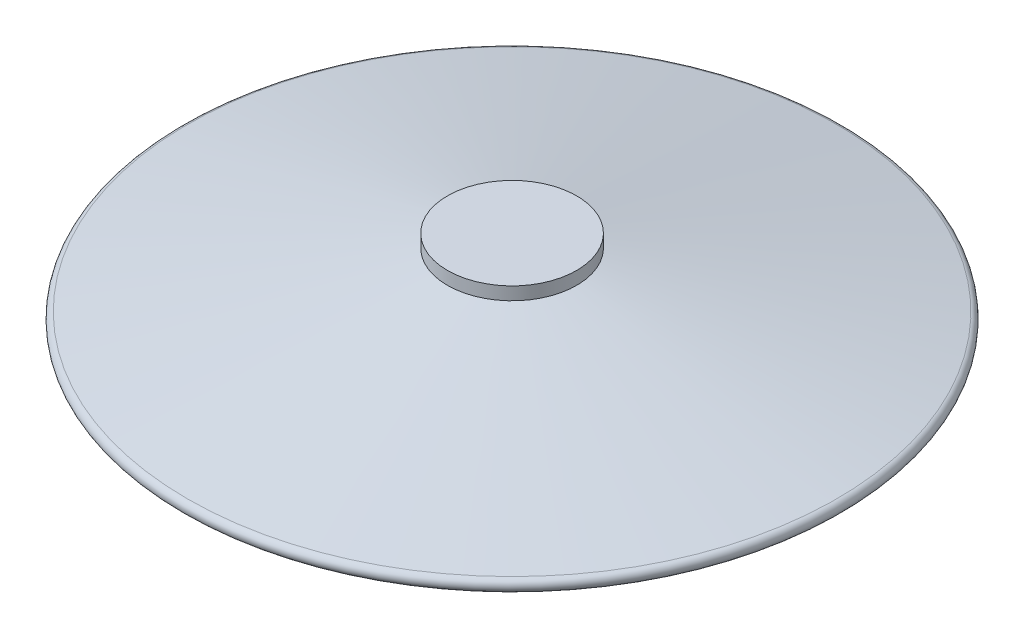
ISO-10303-21;
HEADER;
FILE_DESCRIPTION(('STEP AP214'),'2;1');
FILE_NAME('part.step','',(''),(''),'','','');
FILE_SCHEMA(('AUTOMOTIVE_DESIGN { 1 0 10303 214 1 1 1 1 }'));
ENDSEC;
DATA;
#1=APPLICATION_CONTEXT('core data for automotive mechanical design processes');
#2=APPLICATION_PROTOCOL_DEFINITION('international standard','automotive_design',2000,#1);
#3=PRODUCT_CONTEXT('',#1,'mechanical');
#4=PRODUCT('Part','Part','',(#3));
#5=PRODUCT_RELATED_PRODUCT_CATEGORY('part','',(#4));
#6=PRODUCT_DEFINITION_FORMATION('','',#4);
#7=PRODUCT_DEFINITION_CONTEXT('part definition',#1,'design');
#8=PRODUCT_DEFINITION('design','',#6,#7);
#9=PRODUCT_DEFINITION_SHAPE('','',#8);
#10=(LENGTH_UNIT() NAMED_UNIT(*) SI_UNIT(.MILLI.,.METRE.));
#11=(NAMED_UNIT(*) PLANE_ANGLE_UNIT() SI_UNIT($,.RADIAN.));
#12=(NAMED_UNIT(*) SI_UNIT($,.STERADIAN.) SOLID_ANGLE_UNIT());
#13=UNCERTAINTY_MEASURE_WITH_UNIT(LENGTH_MEASURE(1.E-05),#10,'distance_accuracy_value','');
#14=(GEOMETRIC_REPRESENTATION_CONTEXT(3) GLOBAL_UNCERTAINTY_ASSIGNED_CONTEXT((#13)) GLOBAL_UNIT_ASSIGNED_CONTEXT((#10,
#11,#12)) REPRESENTATION_CONTEXT('',''));
#15=CARTESIAN_POINT('',(0.,0.,0.));
#16=DIRECTION('',(0.,0.,1.));
#17=DIRECTION('',(1.,0.,0.));
#18=AXIS2_PLACEMENT_3D('',#15,#16,#17);
#19=CARTESIAN_POINT('',(0.,6.25,0.));
#20=DIRECTION('',(0.,1.,0.));
#21=DIRECTION('',(0.,0.,1.));
#22=AXIS2_PLACEMENT_3D('',#19,#20,#21);
#23=PLANE('',#22);
#24=CARTESIAN_POINT('',(0.,6.25,0.));
#25=DIRECTION('',(0.,1.,0.));
#26=DIRECTION('',(0.,0.,1.));
#27=AXIS2_PLACEMENT_3D('',#24,#25,#26);
#28=CIRCLE('',#27,5.);
#29=CARTESIAN_POINT('',(0.,6.25,5.));
#30=VERTEX_POINT('',#29);
#31=EDGE_CURVE('E10',#30,#30,#28,.T.);
#32=ORIENTED_EDGE('',*,*,#31,.T.);
#33=EDGE_LOOP('',(#32));
#34=FACE_BOUND('',#33,.T.);
#35=ADVANCED_FACE('F34',(#34),#23,.T.);
#36=CARTESIAN_POINT('',(0.,17.7201574060161,0.));
#37=DIRECTION('',(0.,1.,0.));
#38=DIRECTION('',(0.,0.,1.));
#39=AXIS2_PLACEMENT_3D('',#36,#37,#38);
#40=CYLINDRICAL_SURFACE('',#39,5.);
#41=CARTESIAN_POINT('',(0.,5.25,0.));
#42=DIRECTION('',(0.,1.,0.));
#43=DIRECTION('',(0.,0.,1.));
#44=AXIS2_PLACEMENT_3D('',#41,#42,#43);
#45=CIRCLE('',#44,5.);
#46=CARTESIAN_POINT('',(0.,5.25,5.));
#47=VERTEX_POINT('',#46);
#48=EDGE_CURVE('E40',#47,#47,#45,.T.);
#49=ORIENTED_EDGE('',*,*,#48,.T.);
#50=EDGE_LOOP('',(#49));
#51=FACE_BOUND('',#50,.T.);
#52=ORIENTED_EDGE('',*,*,#31,.F.);
#53=EDGE_LOOP('',(#52));
#54=FACE_BOUND('',#53,.T.);
#55=ADVANCED_FACE('F66',(#51,#54),#40,.T.);
#56=CARTESIAN_POINT('',(0.,5.25,0.));
#57=DIRECTION('',(0.,-1.,0.));
#58=DIRECTION('',(0.,0.,-1.));
#59=AXIS2_PLACEMENT_3D('',#56,#57,#58);
#60=CONICAL_SURFACE('',#59,5.,1.36194233895879);
#61=CARTESIAN_POINT('',(0.,0.989134585003687,0.));
#62=DIRECTION('',(0.,1.,0.));
#63=DIRECTION('',(0.,0.,1.));
#64=AXIS2_PLACEMENT_3D('',#61,#62,#63);
#65=CIRCLE('',#64,25.1036694639384);
#66=CARTESIAN_POINT('',(0.,0.989134585003687,25.1036694639384));
#67=VERTEX_POINT('',#66);
#68=EDGE_CURVE('E44',#67,#67,#65,.T.);
#69=ORIENTED_EDGE('',*,*,#68,.T.);
#70=EDGE_LOOP('',(#69));
#71=FACE_BOUND('',#70,.T.);
#72=ORIENTED_EDGE('',*,*,#48,.F.);
#73=EDGE_LOOP('',(#72));
#74=FACE_BOUND('',#73,.T.);
#75=ADVANCED_FACE('F63',(#71,#74),#60,.T.);
#76=CARTESIAN_POINT('',(0.,0.5,0.));
#77=DIRECTION('',(0.,1.,0.));
#78=DIRECTION('',(0.,0.,1.));
#79=AXIS2_PLACEMENT_3D('',#76,#77,#78);
#80=TOROIDAL_SURFACE('',#79,25.,0.5);
#81=CARTESIAN_POINT('',(0.,0.,0.));
#82=DIRECTION('',(0.,1.,0.));
#83=DIRECTION('',(0.,0.,1.));
#84=AXIS2_PLACEMENT_3D('',#81,#82,#83);
#85=CIRCLE('',#84,25.);
#86=CARTESIAN_POINT('',(0.,0.,25.));
#87=VERTEX_POINT('',#86);
#88=EDGE_CURVE('E48',#87,#87,#85,.T.);
#89=ORIENTED_EDGE('',*,*,#88,.T.);
#90=EDGE_LOOP('',(#89));
#91=FACE_BOUND('',#90,.T.);
#92=ORIENTED_EDGE('',*,*,#68,.F.);
#93=EDGE_LOOP('',(#92));
#94=FACE_BOUND('',#93,.T.);
#95=ADVANCED_FACE('F54',(#91,#94),#80,.T.);
#96=CARTESIAN_POINT('',(-25.,0.,0.));
#97=DIRECTION('',(0.,-1.,0.));
#98=DIRECTION('',(0.,0.,-1.));
#99=AXIS2_PLACEMENT_3D('',#96,#97,#98);
#100=PLANE('',#99);
#101=ORIENTED_EDGE('',*,*,#88,.F.);
#102=EDGE_LOOP('',(#101));
#103=FACE_BOUND('',#102,.T.);
#104=ADVANCED_FACE('F57',(#103),#100,.T.);
#105=CLOSED_SHELL('',(#35,#55,#75,#95,#104));
#106=MANIFOLD_SOLID_BREP('B2',#105);
#107=ADVANCED_BREP_SHAPE_REPRESENTATION('',(#18,#106),#14);
#108=SHAPE_DEFINITION_REPRESENTATION(#9,#107);
ENDSEC;
END-ISO-10303-21;
